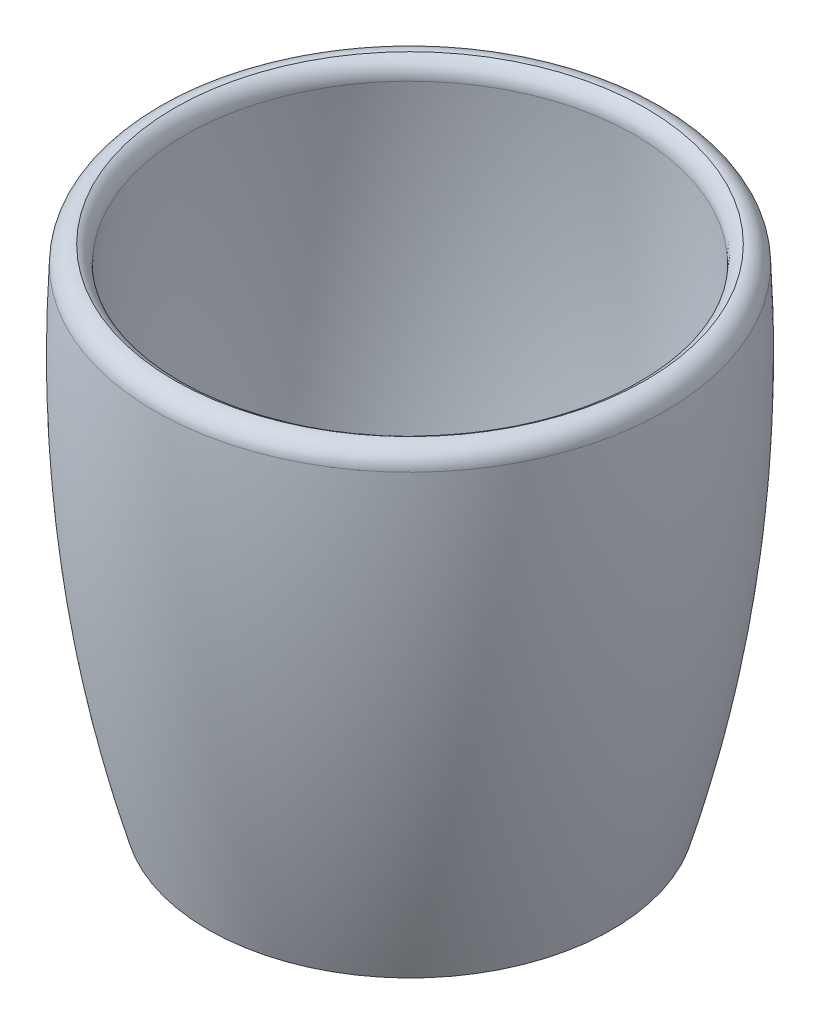
ISO-10303-21;
HEADER;
FILE_DESCRIPTION(('STEP AP214'),'2;1');
FILE_NAME('part.step','',(''),(''),'','','');
FILE_SCHEMA(('AUTOMOTIVE_DESIGN { 1 0 10303 214 1 1 1 1 }'));
ENDSEC;
DATA;
#1=APPLICATION_CONTEXT('core data for automotive mechanical design processes');
#2=APPLICATION_PROTOCOL_DEFINITION('international standard','automotive_design',2000,#1);
#3=PRODUCT_CONTEXT('',#1,'mechanical');
#4=PRODUCT('Part','Part','',(#3));
#5=PRODUCT_RELATED_PRODUCT_CATEGORY('part','',(#4));
#6=PRODUCT_DEFINITION_FORMATION('','',#4);
#7=PRODUCT_DEFINITION_CONTEXT('part definition',#1,'design');
#8=PRODUCT_DEFINITION('design','',#6,#7);
#9=PRODUCT_DEFINITION_SHAPE('','',#8);
#10=(LENGTH_UNIT() NAMED_UNIT(*) SI_UNIT(.MILLI.,.METRE.));
#11=(NAMED_UNIT(*) PLANE_ANGLE_UNIT() SI_UNIT($,.RADIAN.));
#12=(NAMED_UNIT(*) SI_UNIT($,.STERADIAN.) SOLID_ANGLE_UNIT());
#13=UNCERTAINTY_MEASURE_WITH_UNIT(LENGTH_MEASURE(1.E-05),#10,'distance_accuracy_value','');
#14=(GEOMETRIC_REPRESENTATION_CONTEXT(3) GLOBAL_UNCERTAINTY_ASSIGNED_CONTEXT((#13)) GLOBAL_UNIT_ASSIGNED_CONTEXT((#10,
#11,#12)) REPRESENTATION_CONTEXT('',''));
#15=CARTESIAN_POINT('',(0.,0.,0.));
#16=DIRECTION('',(0.,0.,1.));
#17=DIRECTION('',(1.,0.,0.));
#18=AXIS2_PLACEMENT_3D('',#15,#16,#17);
#19=CARTESIAN_POINT('',(0.,5.,0.));
#20=DIRECTION('',(0.,-1.,0.));
#21=DIRECTION('',(0.,0.,-1.));
#22=AXIS2_PLACEMENT_3D('',#19,#20,#21);
#23=PLANE('',#22);
#24=CARTESIAN_POINT('',(0.,5.,0.));
#25=DIRECTION('',(0.,-1.,0.));
#26=DIRECTION('',(0.,0.,-1.));
#27=AXIS2_PLACEMENT_3D('',#24,#25,#26);
#28=CIRCLE('',#27,29.4502672114953);
#29=CARTESIAN_POINT('',(0.,5.,-29.4502672114953));
#30=VERTEX_POINT('',#29);
#31=EDGE_CURVE('E55',#30,#30,#28,.T.);
#32=ORIENTED_EDGE('',*,*,#31,.F.);
#33=EDGE_LOOP('',(#32));
#34=FACE_BOUND('',#33,.T.);
#35=ADVANCED_FACE('F35',(#34),#23,.F.);
#36=CARTESIAN_POINT('',(0.,0.,0.));
#37=DIRECTION('',(0.,1.,0.));
#38=DIRECTION('',(0.,0.,1.));
#39=AXIS2_PLACEMENT_3D('',#36,#37,#38);
#40=PLANE('',#39);
#41=CARTESIAN_POINT('',(0.,0.,0.));
#42=DIRECTION('',(0.,-1.,0.));
#43=DIRECTION('',(0.,0.,-1.));
#44=AXIS2_PLACEMENT_3D('',#41,#42,#43);
#45=CIRCLE('',#44,33.25);
#46=CARTESIAN_POINT('',(0.,0.,-33.25));
#47=VERTEX_POINT('',#46);
#48=EDGE_CURVE('E50',#47,#47,#45,.T.);
#49=ORIENTED_EDGE('',*,*,#48,.T.);
#50=EDGE_LOOP('',(#49));
#51=FACE_BOUND('',#50,.T.);
#52=ADVANCED_FACE('F76',(#51),#40,.F.);
#53=CARTESIAN_POINT('',(41.85,81.4,0.));
#54=CARTESIAN_POINT('',(43.6120839494199,53.3591374940796,0.));
#55=CARTESIAN_POINT('',(40.7705850821435,26.2273970416013,0.));
#56=CARTESIAN_POINT('',(33.25,0.,0.));
#57=B_SPLINE_CURVE_WITH_KNOTS('',3,(#53,#54,#55,#56),.UNSPECIFIED.,.F.,.F.,(4,4),(0.,1.),.UNSPECIFIED.);
#58=CARTESIAN_POINT('',(0.,0.,0.));
#59=DIRECTION('',(0.,-1.,0.));
#60=AXIS1_PLACEMENT('',#58,#59);
#61=SURFACE_OF_REVOLUTION('',#57,#60);
#62=CARTESIAN_POINT('',(0.,78.3698033067487,0.));
#63=DIRECTION('',(0.,-1.,0.));
#64=DIRECTION('',(0.,0.,-1.));
#65=AXIS2_PLACEMENT_3D('',#62,#63,#64);
#66=CIRCLE('',#65,42.0226746951943);
#67=CARTESIAN_POINT('',(0.,78.3698033067487,-42.0226746951943));
#68=VERTEX_POINT('',#67);
#69=EDGE_CURVE('E46',#68,#68,#66,.T.);
#70=ORIENTED_EDGE('',*,*,#69,.T.);
#71=EDGE_LOOP('',(#70));
#72=FACE_BOUND('',#71,.T.);
#73=ORIENTED_EDGE('',*,*,#48,.F.);
#74=EDGE_LOOP('',(#73));
#75=FACE_BOUND('',#74,.T.);
#76=ADVANCED_FACE('F73',(#72,#75),#61,.T.);
#77=CARTESIAN_POINT('',(36.8598429791056,81.0864192180342,0.));
#78=CARTESIAN_POINT('',(37.6834261738659,67.9803562894989,0.));
#79=CARTESIAN_POINT('',(37.4809712081707,55.0937113582373,0.));
#80=CARTESIAN_POINT('',(35.0155626753498,29.7391832110009,0.));
#81=CARTESIAN_POINT('',(32.7527159510745,17.2710261254672,0.));
#82=CARTESIAN_POINT('',(29.4502672114953,5.,0.));
#83=B_SPLINE_CURVE_WITH_KNOTS('',3,(#77,#78,#79,#80,#81,#82),.UNSPECIFIED.,.F.,.F.,(4,2,4),(0.,
0.5,1.),.UNSPECIFIED.);
#84=CARTESIAN_POINT('',(0.,0.,0.));
#85=DIRECTION('',(0.,-1.,0.));
#86=AXIS1_PLACEMENT('',#84,#85);
#87=SURFACE_OF_REVOLUTION('',#83,#86);
#88=CARTESIAN_POINT('',(0.,78.2961500443182,0.));
#89=DIRECTION('',(0.,-1.,0.));
#90=DIRECTION('',(0.,0.,-1.));
#91=AXIS2_PLACEMENT_3D('',#88,#89,#90);
#92=CIRCLE('',#91,37.0198512062597);
#93=CARTESIAN_POINT('',(0.,78.2961500443182,-37.0198512062597));
#94=VERTEX_POINT('',#93);
#95=EDGE_CURVE('E10',#94,#94,#92,.F.);
#96=ORIENTED_EDGE('',*,*,#95,.T.);
#97=EDGE_LOOP('',(#96));
#98=FACE_BOUND('',#97,.T.);
#99=ORIENTED_EDGE('',*,*,#31,.T.);
#100=EDGE_LOOP('',(#99));
#101=FACE_BOUND('',#100,.T.);
#102=ADVANCED_FACE('F69',(#98,#101),#87,.F.);
#103=CARTESIAN_POINT('',(0.,78.2166596202401,0.));
#104=DIRECTION('',(0.,1.,0.));
#105=DIRECTION('',(0.,0.,1.));
#106=AXIS2_PLACEMENT_3D('',#103,#104,#105);
#107=TOROIDAL_SURFACE('',#106,39.0265860764644,3.);
#108=CARTESIAN_POINT('',(0.,81.2107538327767,0.));
#109=DIRECTION('',(0.,-1.,0.));
#110=DIRECTION('',(0.,0.,-1.));
#111=AXIS2_PLACEMENT_3D('',#108,#109,#110);
#112=CIRCLE('',#111,38.8384376072849);
#113=CARTESIAN_POINT('',(0.,81.2107538327767,-38.8384376072849));
#114=VERTEX_POINT('',#113);
#115=EDGE_CURVE('E42',#114,#114,#112,.F.);
#116=ORIENTED_EDGE('',*,*,#115,.F.);
#117=EDGE_LOOP('',(#116));
#118=FACE_BOUND('',#117,.T.);
#119=ORIENTED_EDGE('',*,*,#69,.F.);
#120=EDGE_LOOP('',(#119));
#121=FACE_BOUND('',#120,.T.);
#122=ADVANCED_FACE('F72',(#118,#121),#107,.T.);
#123=CARTESIAN_POINT('',(0.,78.4514513710455,0.));
#124=DIRECTION('',(0.,-1.,0.));
#125=DIRECTION('',(0.,0.,-1.));
#126=AXIS2_PLACEMENT_3D('',#123,#124,#125);
#127=TOROIDAL_SURFACE('',#126,40.0158287592325,3.);
#128=ORIENTED_EDGE('',*,*,#95,.F.);
#129=EDGE_LOOP('',(#128));
#130=FACE_BOUND('',#129,.T.);
#131=ORIENTED_EDGE('',*,*,#115,.T.);
#132=EDGE_LOOP('',(#131));
#133=FACE_BOUND('',#132,.T.);
#134=ADVANCED_FACE('F37',(#130,#133),#127,.T.);
#135=CLOSED_SHELL('',(#35,#52,#76,#102,#122,#134));
#136=MANIFOLD_SOLID_BREP('B2',#135);
#137=ADVANCED_BREP_SHAPE_REPRESENTATION('',(#18,#136),#14);
#138=SHAPE_DEFINITION_REPRESENTATION(#9,#137);
ENDSEC;
END-ISO-10303-21;
